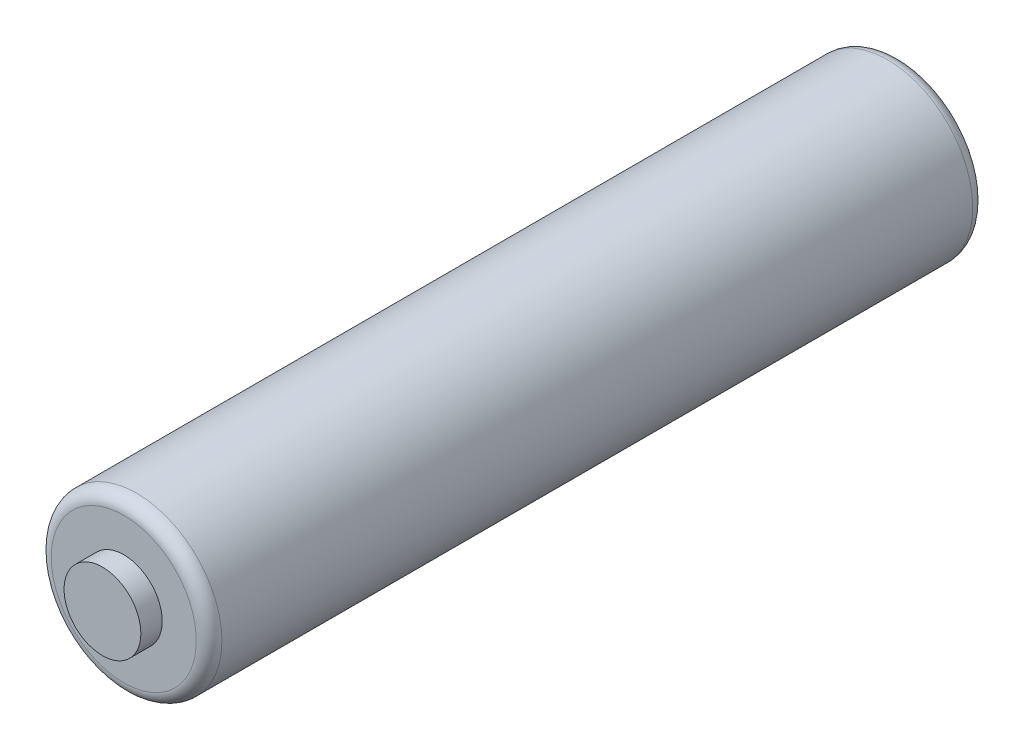
ISO-10303-21;
HEADER;
FILE_DESCRIPTION(('STEP AP214'),'2;1');
FILE_NAME('part.step','',(''),(''),'','','');
FILE_SCHEMA(('AUTOMOTIVE_DESIGN { 1 0 10303 214 1 1 1 1 }'));
ENDSEC;
DATA;
#1=APPLICATION_CONTEXT('core data for automotive mechanical design processes');
#2=APPLICATION_PROTOCOL_DEFINITION('international standard','automotive_design',2000,#1);
#3=PRODUCT_CONTEXT('',#1,'mechanical');
#4=PRODUCT('Part','Part','',(#3));
#5=PRODUCT_RELATED_PRODUCT_CATEGORY('part','',(#4));
#6=PRODUCT_DEFINITION_FORMATION('','',#4);
#7=PRODUCT_DEFINITION_CONTEXT('part definition',#1,'design');
#8=PRODUCT_DEFINITION('design','',#6,#7);
#9=PRODUCT_DEFINITION_SHAPE('','',#8);
#10=(LENGTH_UNIT() NAMED_UNIT(*) SI_UNIT(.MILLI.,.METRE.));
#11=(NAMED_UNIT(*) PLANE_ANGLE_UNIT() SI_UNIT($,.RADIAN.));
#12=(NAMED_UNIT(*) SI_UNIT($,.STERADIAN.) SOLID_ANGLE_UNIT());
#13=UNCERTAINTY_MEASURE_WITH_UNIT(LENGTH_MEASURE(1.E-05),#10,'distance_accuracy_value','');
#14=(GEOMETRIC_REPRESENTATION_CONTEXT(3) GLOBAL_UNCERTAINTY_ASSIGNED_CONTEXT((#13)) GLOBAL_UNIT_ASSIGNED_CONTEXT((#10,
#11,#12)) REPRESENTATION_CONTEXT('',''));
#15=CARTESIAN_POINT('',(0.,0.,0.));
#16=DIRECTION('',(0.,0.,1.));
#17=DIRECTION('',(1.,0.,0.));
#18=AXIS2_PLACEMENT_3D('',#15,#16,#17);
#19=CARTESIAN_POINT('',(0.,-7.14375000000001,152.4));
#20=DIRECTION('',(0.,0.,-1.));
#21=DIRECTION('',(-1.,0.,0.));
#22=AXIS2_PLACEMENT_3D('',#19,#20,#21);
#23=PLANE('',#22);
#24=CARTESIAN_POINT('',(0.,-7.14375000000001,152.4));
#25=DIRECTION('',(0.,0.,1.));
#26=DIRECTION('',(1.,0.,0.));
#27=AXIS2_PLACEMENT_3D('',#24,#25,#26);
#28=CIRCLE('',#27,14.2875);
#29=CARTESIAN_POINT('',(14.2875,-7.14375000000001,152.4));
#30=VERTEX_POINT('',#29);
#31=EDGE_CURVE('E51',#30,#30,#28,.T.);
#32=ORIENTED_EDGE('',*,*,#31,.T.);
#33=EDGE_LOOP('',(#32));
#34=FACE_BOUND('',#33,.T.);
#35=ADVANCED_FACE('F31',(#34),#23,.F.);
#36=CARTESIAN_POINT('',(0.,-7.14375000000001,152.4));
#37=DIRECTION('',(0.,0.,1.));
#38=DIRECTION('',(1.,0.,0.));
#39=AXIS2_PLACEMENT_3D('',#36,#37,#38);
#40=CYLINDRICAL_SURFACE('',#39,14.2875);
#41=ORIENTED_EDGE('',*,*,#31,.F.);
#42=EDGE_LOOP('',(#41));
#43=FACE_BOUND('',#42,.T.);
#44=CARTESIAN_POINT('',(0.,-7.14375000000001,144.4625));
#45=DIRECTION('',(0.,0.,1.));
#46=DIRECTION('',(1.,0.,0.));
#47=AXIS2_PLACEMENT_3D('',#44,#45,#46);
#48=CIRCLE('',#47,14.2875);
#49=CARTESIAN_POINT('',(14.2875,-7.14375000000001,144.4625));
#50=VERTEX_POINT('',#49);
#51=EDGE_CURVE('E54',#50,#50,#48,.T.);
#52=ORIENTED_EDGE('',*,*,#51,.T.);
#53=EDGE_LOOP('',(#52));
#54=FACE_BOUND('',#53,.T.);
#55=ADVANCED_FACE('F79',(#43,#54),#40,.T.);
#56=CARTESIAN_POINT('',(0.,7.14374999999995,144.4625));
#57=DIRECTION('',(0.,0.,-1.));
#58=DIRECTION('',(-1.,0.,0.));
#59=AXIS2_PLACEMENT_3D('',#56,#57,#58);
#60=PLANE('',#59);
#61=CARTESIAN_POINT('',(0.,-7.14375000000001,144.4625));
#62=DIRECTION('',(0.,0.,-1.));
#63=DIRECTION('',(-1.,0.,0.));
#64=AXIS2_PLACEMENT_3D('',#61,#62,#63);
#65=CIRCLE('',#64,26.9875);
#66=CARTESIAN_POINT('',(-26.9875,-7.14375000000001,144.4625));
#67=VERTEX_POINT('',#66);
#68=EDGE_CURVE('E10',#67,#67,#65,.F.);
#69=ORIENTED_EDGE('',*,*,#68,.T.);
#70=EDGE_LOOP('',(#69));
#71=FACE_BOUND('',#70,.T.);
#72=ORIENTED_EDGE('',*,*,#51,.F.);
#73=EDGE_LOOP('',(#72));
#74=FACE_BOUND('',#73,.T.);
#75=ADVANCED_FACE('F85',(#71,#74),#60,.F.);
#76=CARTESIAN_POINT('',(0.,-7.14375000000001,152.4));
#77=DIRECTION('',(0.,0.,1.));
#78=DIRECTION('',(1.,0.,0.));
#79=AXIS2_PLACEMENT_3D('',#76,#77,#78);
#80=CYLINDRICAL_SURFACE('',#79,31.75);
#81=CARTESIAN_POINT('',(0.,-7.14375000000001,-139.7));
#82=DIRECTION('',(0.,0.,1.));
#83=DIRECTION('',(1.,0.,0.));
#84=AXIS2_PLACEMENT_3D('',#81,#82,#83);
#85=CIRCLE('',#84,31.75);
#86=CARTESIAN_POINT('',(31.75,-7.14375000000001,-139.7));
#87=VERTEX_POINT('',#86);
#88=EDGE_CURVE('E42',#87,#87,#85,.T.);
#89=ORIENTED_EDGE('',*,*,#88,.T.);
#90=EDGE_LOOP('',(#89));
#91=FACE_BOUND('',#90,.T.);
#92=CARTESIAN_POINT('',(0.,-7.14375000000001,139.7));
#93=DIRECTION('',(0.,0.,-1.));
#94=DIRECTION('',(-1.,0.,0.));
#95=AXIS2_PLACEMENT_3D('',#92,#93,#94);
#96=CIRCLE('',#95,31.75);
#97=CARTESIAN_POINT('',(-31.75,-7.14375000000001,139.7));
#98=VERTEX_POINT('',#97);
#99=EDGE_CURVE('E46',#98,#98,#96,.T.);
#100=ORIENTED_EDGE('',*,*,#99,.T.);
#101=EDGE_LOOP('',(#100));
#102=FACE_BOUND('',#101,.T.);
#103=ADVANCED_FACE('F91',(#91,#102),#80,.T.);
#104=CARTESIAN_POINT('',(0.,7.14374999999999,-144.4625));
#105=DIRECTION('',(0.,0.,1.));
#106=DIRECTION('',(1.,0.,0.));
#107=AXIS2_PLACEMENT_3D('',#104,#105,#106);
#108=PLANE('',#107);
#109=CARTESIAN_POINT('',(0.,-7.14375000000001,-144.4625));
#110=DIRECTION('',(0.,0.,1.));
#111=DIRECTION('',(1.,0.,0.));
#112=AXIS2_PLACEMENT_3D('',#109,#110,#111);
#113=CIRCLE('',#112,26.9875);
#114=CARTESIAN_POINT('',(26.9875,-7.14375000000001,-144.4625));
#115=VERTEX_POINT('',#114);
#116=EDGE_CURVE('E38',#115,#115,#113,.F.);
#117=ORIENTED_EDGE('',*,*,#116,.T.);
#118=EDGE_LOOP('',(#117));
#119=FACE_BOUND('',#118,.T.);
#120=CARTESIAN_POINT('',(0.,-7.14375000000001,-144.4625));
#121=DIRECTION('',(0.,0.,1.));
#122=DIRECTION('',(1.,0.,0.));
#123=AXIS2_PLACEMENT_3D('',#120,#121,#122);
#124=CIRCLE('',#123,14.2875);
#125=CARTESIAN_POINT('',(14.2875,-7.14375000000001,-144.4625));
#126=VERTEX_POINT('',#125);
#127=EDGE_CURVE('E57',#126,#126,#124,.T.);
#128=ORIENTED_EDGE('',*,*,#127,.T.);
#129=EDGE_LOOP('',(#128));
#130=FACE_BOUND('',#129,.T.);
#131=ADVANCED_FACE('F75',(#119,#130),#108,.F.);
#132=CARTESIAN_POINT('',(0.,-7.14375000000001,152.4));
#133=DIRECTION('',(0.,0.,1.));
#134=DIRECTION('',(1.,0.,0.));
#135=AXIS2_PLACEMENT_3D('',#132,#133,#134);
#136=CYLINDRICAL_SURFACE('',#135,14.2875);
#137=ORIENTED_EDGE('',*,*,#127,.F.);
#138=EDGE_LOOP('',(#137));
#139=FACE_BOUND('',#138,.T.);
#140=CARTESIAN_POINT('',(0.,-7.14375000000001,-152.4));
#141=DIRECTION('',(0.,0.,1.));
#142=DIRECTION('',(1.,0.,0.));
#143=AXIS2_PLACEMENT_3D('',#140,#141,#142);
#144=CIRCLE('',#143,14.2875);
#145=CARTESIAN_POINT('',(14.2875,-7.14375000000001,-152.4));
#146=VERTEX_POINT('',#145);
#147=EDGE_CURVE('E60',#146,#146,#144,.T.);
#148=ORIENTED_EDGE('',*,*,#147,.T.);
#149=EDGE_LOOP('',(#148));
#150=FACE_BOUND('',#149,.T.);
#151=ADVANCED_FACE('F64',(#139,#150),#136,.T.);
#152=CARTESIAN_POINT('',(0.,-7.14375000000001,-152.4));
#153=DIRECTION('',(0.,0.,1.));
#154=DIRECTION('',(1.,0.,0.));
#155=AXIS2_PLACEMENT_3D('',#152,#153,#154);
#156=PLANE('',#155);
#157=ORIENTED_EDGE('',*,*,#147,.F.);
#158=EDGE_LOOP('',(#157));
#159=FACE_BOUND('',#158,.T.);
#160=ADVANCED_FACE('F66',(#159),#156,.F.);
#161=CARTESIAN_POINT('',(0.,-7.14375000000001,-139.7));
#162=DIRECTION('',(0.,0.,1.));
#163=DIRECTION('',(1.,0.,0.));
#164=AXIS2_PLACEMENT_3D('',#161,#162,#163);
#165=TOROIDAL_SURFACE('',#164,26.9875,4.7625);
#166=ORIENTED_EDGE('',*,*,#116,.F.);
#167=EDGE_LOOP('',(#166));
#168=FACE_BOUND('',#167,.T.);
#169=ORIENTED_EDGE('',*,*,#88,.F.);
#170=EDGE_LOOP('',(#169));
#171=FACE_BOUND('',#170,.T.);
#172=ADVANCED_FACE('F68',(#168,#171),#165,.T.);
#173=CARTESIAN_POINT('',(0.,-7.14375000000001,139.7));
#174=DIRECTION('',(0.,0.,-1.));
#175=DIRECTION('',(-1.,0.,0.));
#176=AXIS2_PLACEMENT_3D('',#173,#174,#175);
#177=TOROIDAL_SURFACE('',#176,26.9875,4.7625);
#178=ORIENTED_EDGE('',*,*,#99,.F.);
#179=EDGE_LOOP('',(#178));
#180=FACE_BOUND('',#179,.T.);
#181=ORIENTED_EDGE('',*,*,#68,.F.);
#182=EDGE_LOOP('',(#181));
#183=FACE_BOUND('',#182,.T.);
#184=ADVANCED_FACE('F33',(#180,#183),#177,.T.);
#185=CLOSED_SHELL('',(#35,#55,#75,#103,#131,#151,#160,#172,#184));
#186=MANIFOLD_SOLID_BREP('B2',#185);
#187=ADVANCED_BREP_SHAPE_REPRESENTATION('',(#18,#186),#14);
#188=SHAPE_DEFINITION_REPRESENTATION(#9,#187);
ENDSEC;
END-ISO-10303-21;
